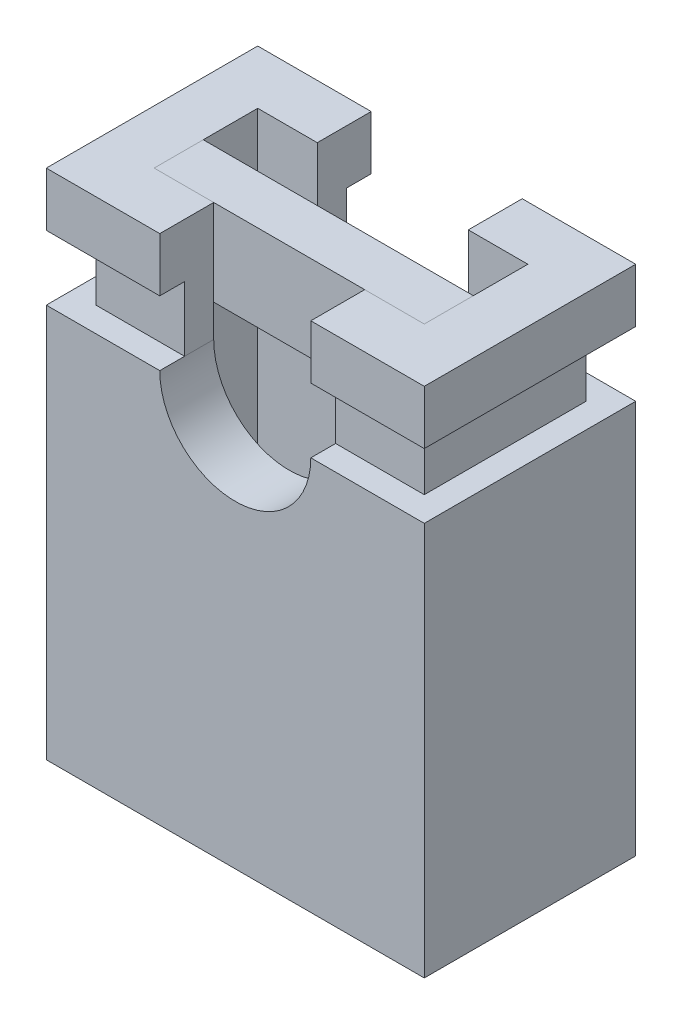
ISO-10303-21;
HEADER;
FILE_DESCRIPTION(('STEP AP214'),'2;1');
FILE_NAME('part.step','',(''),(''),'','','');
FILE_SCHEMA(('AUTOMOTIVE_DESIGN { 1 0 10303 214 1 1 1 1 }'));
ENDSEC;
DATA;
#1=APPLICATION_CONTEXT('core data for automotive mechanical design processes');
#2=APPLICATION_PROTOCOL_DEFINITION('international standard','automotive_design',2000,#1);
#3=PRODUCT_CONTEXT('',#1,'mechanical');
#4=PRODUCT('Part','Part','',(#3));
#5=PRODUCT_RELATED_PRODUCT_CATEGORY('part','',(#4));
#6=PRODUCT_DEFINITION_FORMATION('','',#4);
#7=PRODUCT_DEFINITION_CONTEXT('part definition',#1,'design');
#8=PRODUCT_DEFINITION('design','',#6,#7);
#9=PRODUCT_DEFINITION_SHAPE('','',#8);
#10=(LENGTH_UNIT() NAMED_UNIT(*) SI_UNIT(.MILLI.,.METRE.));
#11=(NAMED_UNIT(*) PLANE_ANGLE_UNIT() SI_UNIT($,.RADIAN.));
#12=(NAMED_UNIT(*) SI_UNIT($,.STERADIAN.) SOLID_ANGLE_UNIT());
#13=UNCERTAINTY_MEASURE_WITH_UNIT(LENGTH_MEASURE(1.E-05),#10,'distance_accuracy_value','');
#14=(GEOMETRIC_REPRESENTATION_CONTEXT(3) GLOBAL_UNCERTAINTY_ASSIGNED_CONTEXT((#13)) GLOBAL_UNIT_ASSIGNED_CONTEXT((#10,
#11,#12)) REPRESENTATION_CONTEXT('',''));
#15=CARTESIAN_POINT('',(0.,0.,0.));
#16=DIRECTION('',(0.,0.,1.));
#17=DIRECTION('',(1.,0.,0.));
#18=AXIS2_PLACEMENT_3D('',#15,#16,#17);
#19=CARTESIAN_POINT('',(0.,0.,0.03175));
#20=DIRECTION('',(0.,0.,1.));
#21=DIRECTION('',(1.,0.,0.));
#22=AXIS2_PLACEMENT_3D('',#19,#20,#21);
#23=PLANE('',#22);
#24=DIRECTION('',(1.,0.,0.));
#25=VECTOR('',#24,1.);
#26=CARTESIAN_POINT('',(-1.59,0.,0.03175));
#27=LINE('',#26,#25);
#28=CARTESIAN_POINT('',(1.59,0.,0.03175));
#29=VERTEX_POINT('',#28);
#30=CARTESIAN_POINT('',(-1.59,0.,0.03175));
#31=VERTEX_POINT('',#30);
#32=EDGE_CURVE('P0_E78',#29,#31,#27,.F.);
#33=ORIENTED_EDGE('',*,*,#32,.F.);
#34=DIRECTION('',(0.,1.,0.));
#35=VECTOR('',#34,1.);
#36=CARTESIAN_POINT('',(1.59,0.,0.03175));
#37=LINE('',#36,#35);
#38=CARTESIAN_POINT('',(1.59,-1.016,0.03175));
#39=VERTEX_POINT('',#38);
#40=EDGE_CURVE('P0_E54',#39,#29,#37,.T.);
#41=ORIENTED_EDGE('',*,*,#40,.F.);
#42=DIRECTION('',(1.,0.,0.));
#43=VECTOR('',#42,1.);
#44=CARTESIAN_POINT('',(-1.59,-1.016,0.03175));
#45=LINE('',#44,#43);
#46=CARTESIAN_POINT('',(-1.59,-1.016,0.03175));
#47=VERTEX_POINT('',#46);
#48=EDGE_CURVE('P0_E66',#39,#47,#45,.F.);
#49=ORIENTED_EDGE('',*,*,#48,.T.);
#50=DIRECTION('',(0.,1.,0.));
#51=VECTOR('',#50,1.);
#52=CARTESIAN_POINT('',(-1.59,0.,0.03175));
#53=LINE('',#52,#51);
#54=EDGE_CURVE('P0_E19',#47,#31,#53,.T.);
#55=ORIENTED_EDGE('',*,*,#54,.T.);
#56=EDGE_LOOP('',(#33,#41,#49,#55));
#57=FACE_BOUND('',#56,.T.);
#58=ADVANCED_FACE('P0_F16',(#57),#23,.F.);
#59=CARTESIAN_POINT('',(-1.59,0.,0.609599999999999));
#60=DIRECTION('',(1.,0.,0.));
#61=DIRECTION('',(0.,1.,0.));
#62=AXIS2_PLACEMENT_3D('',#59,#60,#61);
#63=PLANE('',#62);
#64=DIRECTION('',(0.,0.,1.));
#65=VECTOR('',#64,1.);
#66=CARTESIAN_POINT('',(-1.59,-1.016,0.609599999999999));
#67=LINE('',#66,#65);
#68=CARTESIAN_POINT('',(-1.59,-1.016,0.609599999999999));
#69=VERTEX_POINT('',#68);
#70=EDGE_CURVE('P0_E61',#47,#69,#67,.T.);
#71=ORIENTED_EDGE('',*,*,#70,.T.);
#72=DIRECTION('',(0.,1.,0.));
#73=VECTOR('',#72,1.);
#74=CARTESIAN_POINT('',(-1.59,0.,0.609599999999999));
#75=LINE('',#74,#73);
#76=CARTESIAN_POINT('',(-1.59,0.,0.609599999999999));
#77=VERTEX_POINT('',#76);
#78=EDGE_CURVE('P0_E82',#77,#69,#75,.F.);
#79=ORIENTED_EDGE('',*,*,#78,.F.);
#80=DIRECTION('',(0.,0.,1.));
#81=VECTOR('',#80,1.);
#82=CARTESIAN_POINT('',(-1.59,0.,0.609599999999999));
#83=LINE('',#82,#81);
#84=EDGE_CURVE('P0_E64',#31,#77,#83,.T.);
#85=ORIENTED_EDGE('',*,*,#84,.F.);
#86=ORIENTED_EDGE('',*,*,#54,.F.);
#87=EDGE_LOOP('',(#71,#79,#85,#86));
#88=FACE_BOUND('',#87,.T.);
#89=ADVANCED_FACE('P0_F59',(#88),#63,.F.);
#90=CARTESIAN_POINT('',(-1.59,-1.016,0.609599999999999));
#91=DIRECTION('',(0.,1.,0.));
#92=DIRECTION('',(0.,0.,1.));
#93=AXIS2_PLACEMENT_3D('',#90,#91,#92);
#94=PLANE('',#93);
#95=DIRECTION('',(0.,0.,1.));
#96=VECTOR('',#95,1.);
#97=CARTESIAN_POINT('',(1.59,-1.016,0.609599999999999));
#98=LINE('',#97,#96);
#99=CARTESIAN_POINT('',(1.59,-1.016,0.609599999999999));
#100=VERTEX_POINT('',#99);
#101=EDGE_CURVE('P0_E76',#100,#39,#98,.F.);
#102=ORIENTED_EDGE('',*,*,#101,.F.);
#103=DIRECTION('',(1.,0.,0.));
#104=VECTOR('',#103,1.);
#105=CARTESIAN_POINT('',(0.,-1.016,0.609599999999999));
#106=LINE('',#105,#104);
#107=EDGE_CURVE('P0_E72',#69,#100,#106,.T.);
#108=ORIENTED_EDGE('',*,*,#107,.F.);
#109=ORIENTED_EDGE('',*,*,#70,.F.);
#110=ORIENTED_EDGE('',*,*,#48,.F.);
#111=EDGE_LOOP('',(#102,#108,#109,#110));
#112=FACE_BOUND('',#111,.T.);
#113=ADVANCED_FACE('P0_F70',(#112),#94,.F.);
#114=CARTESIAN_POINT('',(1.59,0.,0.609599999999999));
#115=DIRECTION('',(1.,0.,0.));
#116=DIRECTION('',(0.,1.,0.));
#117=AXIS2_PLACEMENT_3D('',#114,#115,#116);
#118=PLANE('',#117);
#119=DIRECTION('',(0.,1.,0.));
#120=VECTOR('',#119,1.);
#121=CARTESIAN_POINT('',(1.59,0.,0.609599999999999));
#122=LINE('',#121,#120);
#123=CARTESIAN_POINT('',(1.59,0.,0.609599999999999));
#124=VERTEX_POINT('',#123);
#125=EDGE_CURVE('P0_E25',#100,#124,#122,.T.);
#126=ORIENTED_EDGE('',*,*,#125,.F.);
#127=ORIENTED_EDGE('',*,*,#101,.T.);
#128=ORIENTED_EDGE('',*,*,#40,.T.);
#129=DIRECTION('',(0.,0.,1.));
#130=VECTOR('',#129,1.);
#131=CARTESIAN_POINT('',(1.59,0.,0.609599999999999));
#132=LINE('',#131,#130);
#133=EDGE_CURVE('P0_E34',#124,#29,#132,.F.);
#134=ORIENTED_EDGE('',*,*,#133,.F.);
#135=EDGE_LOOP('',(#126,#127,#128,#134));
#136=FACE_BOUND('',#135,.T.);
#137=ADVANCED_FACE('P0_F88',(#136),#118,.T.);
#138=CARTESIAN_POINT('',(-1.59,0.,0.609599999999999));
#139=DIRECTION('',(0.,1.,0.));
#140=DIRECTION('',(0.,0.,1.));
#141=AXIS2_PLACEMENT_3D('',#138,#139,#140);
#142=PLANE('',#141);
#143=DIRECTION('',(1.,0.,0.));
#144=VECTOR('',#143,1.);
#145=CARTESIAN_POINT('',(0.,0.,0.609599999999999));
#146=LINE('',#145,#144);
#147=EDGE_CURVE('P0_E11',#124,#77,#146,.F.);
#148=ORIENTED_EDGE('',*,*,#147,.F.);
#149=ORIENTED_EDGE('',*,*,#133,.T.);
#150=ORIENTED_EDGE('',*,*,#32,.T.);
#151=ORIENTED_EDGE('',*,*,#84,.T.);
#152=EDGE_LOOP('',(#148,#149,#150,#151));
#153=FACE_BOUND('',#152,.T.);
#154=ADVANCED_FACE('P0_F90',(#153),#142,.T.);
#155=CARTESIAN_POINT('',(0.,0.,0.609599999999999));
#156=DIRECTION('',(0.,0.,1.));
#157=DIRECTION('',(1.,0.,0.));
#158=AXIS2_PLACEMENT_3D('',#155,#156,#157);
#159=PLANE('',#158);
#160=ORIENTED_EDGE('',*,*,#125,.T.);
#161=ORIENTED_EDGE('',*,*,#147,.T.);
#162=ORIENTED_EDGE('',*,*,#78,.T.);
#163=ORIENTED_EDGE('',*,*,#107,.T.);
#164=EDGE_LOOP('',(#160,#161,#162,#163));
#165=FACE_BOUND('',#164,.T.);
#166=ADVANCED_FACE('P0_F87',(#165),#159,.T.);
#167=CLOSED_SHELL('',(#58,#89,#113,#137,#154,#166));
#168=MANIFOLD_SOLID_BREP('P0_B1',#167);
#169=CARTESIAN_POINT('',(0.,0.,0.));
#170=DIRECTION('',(0.,1.,0.));
#171=DIRECTION('',(0.,0.,1.));
#172=AXIS2_PLACEMENT_3D('',#169,#170,#171);
#173=PLANE('',#172);
#174=DIRECTION('',(1.,0.,0.));
#175=VECTOR('',#174,1.);
#176=CARTESIAN_POINT('',(-2.225,0.,1.2446));
#177=LINE('',#176,#175);
#178=CARTESIAN_POINT('',(2.225,0.,1.2446));
#179=VERTEX_POINT('',#178);
#180=CARTESIAN_POINT('',(0.889,0.,1.2446));
#181=VERTEX_POINT('',#180);
#182=EDGE_CURVE('P1_E463',#179,#181,#177,.F.);
#183=ORIENTED_EDGE('',*,*,#182,.F.);
#184=DIRECTION('',(0.,0.,-1.));
#185=VECTOR('',#184,1.);
#186=CARTESIAN_POINT('',(2.225,0.,-1.2446));
#187=LINE('',#186,#185);
#188=CARTESIAN_POINT('',(2.225,0.,-1.2446));
#189=VERTEX_POINT('',#188);
#190=EDGE_CURVE('P1_E435',#189,#179,#187,.F.);
#191=ORIENTED_EDGE('',*,*,#190,.F.);
#192=DIRECTION('',(-1.,0.,0.));
#193=VECTOR('',#192,1.);
#194=CARTESIAN_POINT('',(-2.225,0.,-1.2446));
#195=LINE('',#194,#193);
#196=CARTESIAN_POINT('',(0.889,0.,-1.2446));
#197=VERTEX_POINT('',#196);
#198=EDGE_CURVE('P1_E454',#197,#189,#195,.F.);
#199=ORIENTED_EDGE('',*,*,#198,.F.);
#200=DIRECTION('',(0.,0.,1.));
#201=VECTOR('',#200,1.);
#202=CARTESIAN_POINT('',(0.889,0.,0.));
#203=LINE('',#202,#201);
#204=CARTESIAN_POINT('',(0.889,0.,-0.6096));
#205=VERTEX_POINT('',#204);
#206=EDGE_CURVE('P1_E502',#197,#205,#203,.T.);
#207=ORIENTED_EDGE('',*,*,#206,.T.);
#208=DIRECTION('',(1.,0.,0.));
#209=VECTOR('',#208,1.);
#210=CARTESIAN_POINT('',(0.,0.,-0.609600000000001));
#211=LINE('',#210,#209);
#212=CARTESIAN_POINT('',(1.59,0.,-0.6096));
#213=VERTEX_POINT('',#212);
#214=EDGE_CURVE('P1_E505',#205,#213,#211,.T.);
#215=ORIENTED_EDGE('',*,*,#214,.T.);
#216=DIRECTION('',(0.,0.,1.));
#217=VECTOR('',#216,1.);
#218=CARTESIAN_POINT('',(1.59,0.,0.));
#219=LINE('',#218,#217);
#220=CARTESIAN_POINT('',(1.59,0.,0.6096));
#221=VERTEX_POINT('',#220);
#222=EDGE_CURVE('P1_E540',#213,#221,#219,.T.);
#223=ORIENTED_EDGE('',*,*,#222,.T.);
#224=DIRECTION('',(1.,0.,0.));
#225=VECTOR('',#224,1.);
#226=CARTESIAN_POINT('',(0.,0.,0.6096));
#227=LINE('',#226,#225);
#228=CARTESIAN_POINT('',(0.889,0.,0.6096));
#229=VERTEX_POINT('',#228);
#230=EDGE_CURVE('P1_E510',#221,#229,#227,.F.);
#231=ORIENTED_EDGE('',*,*,#230,.T.);
#232=DIRECTION('',(0.,0.,1.));
#233=VECTOR('',#232,1.);
#234=CARTESIAN_POINT('',(0.889,0.,0.));
#235=LINE('',#234,#233);
#236=EDGE_CURVE('P1_E508',#229,#181,#235,.T.);
#237=ORIENTED_EDGE('',*,*,#236,.T.);
#238=EDGE_LOOP('',(#183,#191,#199,#207,#215,#223,#231,#237));
#239=FACE_BOUND('',#238,.T.);
#240=ADVANCED_FACE('P1_F16',(#239),#173,.T.);
#241=CARTESIAN_POINT('',(0.,0.,0.));
#242=DIRECTION('',(0.,1.,0.));
#243=DIRECTION('',(0.,0.,1.));
#244=AXIS2_PLACEMENT_3D('',#241,#242,#243);
#245=PLANE('',#244);
#246=DIRECTION('',(0.,0.,1.));
#247=VECTOR('',#246,1.);
#248=CARTESIAN_POINT('',(-1.59,0.,0.));
#249=LINE('',#248,#247);
#250=CARTESIAN_POINT('',(-1.59,0.,0.609599999999999));
#251=VERTEX_POINT('',#250);
#252=CARTESIAN_POINT('',(-1.59,0.,-0.6096));
#253=VERTEX_POINT('',#252);
#254=EDGE_CURVE('P1_E519',#251,#253,#249,.F.);
#255=ORIENTED_EDGE('',*,*,#254,.T.);
#256=DIRECTION('',(1.,0.,0.));
#257=VECTOR('',#256,1.);
#258=CARTESIAN_POINT('',(0.,0.,-0.6096));
#259=LINE('',#258,#257);
#260=CARTESIAN_POINT('',(-0.889,0.,-0.6096));
#261=VERTEX_POINT('',#260);
#262=EDGE_CURVE('P1_E492',#253,#261,#259,.T.);
#263=ORIENTED_EDGE('',*,*,#262,.T.);
#264=DIRECTION('',(0.,0.,1.));
#265=VECTOR('',#264,1.);
#266=CARTESIAN_POINT('',(-0.889,0.,0.));
#267=LINE('',#266,#265);
#268=CARTESIAN_POINT('',(-0.889,0.,-1.2446));
#269=VERTEX_POINT('',#268);
#270=EDGE_CURVE('P1_E481',#261,#269,#267,.F.);
#271=ORIENTED_EDGE('',*,*,#270,.T.);
#272=DIRECTION('',(1.,0.,0.));
#273=VECTOR('',#272,1.);
#274=CARTESIAN_POINT('',(0.,0.,-1.2446));
#275=LINE('',#274,#273);
#276=CARTESIAN_POINT('',(-2.225,0.,-1.2446));
#277=VERTEX_POINT('',#276);
#278=EDGE_CURVE('P1_E478',#269,#277,#275,.F.);
#279=ORIENTED_EDGE('',*,*,#278,.T.);
#280=DIRECTION('',(0.,0.,1.));
#281=VECTOR('',#280,1.);
#282=CARTESIAN_POINT('',(-2.225,0.,-1.2446));
#283=LINE('',#282,#281);
#284=CARTESIAN_POINT('',(-2.225,0.,1.2446));
#285=VERTEX_POINT('',#284);
#286=EDGE_CURVE('P1_E415',#285,#277,#283,.F.);
#287=ORIENTED_EDGE('',*,*,#286,.F.);
#288=DIRECTION('',(1.,0.,0.));
#289=VECTOR('',#288,1.);
#290=CARTESIAN_POINT('',(-2.225,0.,1.2446));
#291=LINE('',#290,#289);
#292=CARTESIAN_POINT('',(-0.889,0.,1.2446));
#293=VERTEX_POINT('',#292);
#294=EDGE_CURVE('P1_E429',#293,#285,#291,.F.);
#295=ORIENTED_EDGE('',*,*,#294,.F.);
#296=DIRECTION('',(0.,0.,1.));
#297=VECTOR('',#296,1.);
#298=CARTESIAN_POINT('',(-0.889,0.,0.));
#299=LINE('',#298,#297);
#300=CARTESIAN_POINT('',(-0.889,0.,0.609599999999999));
#301=VERTEX_POINT('',#300);
#302=EDGE_CURVE('P1_E480',#293,#301,#299,.F.);
#303=ORIENTED_EDGE('',*,*,#302,.T.);
#304=DIRECTION('',(1.,0.,0.));
#305=VECTOR('',#304,1.);
#306=CARTESIAN_POINT('',(0.,0.,0.609599999999999));
#307=LINE('',#306,#305);
#308=EDGE_CURVE('P1_E216',#301,#251,#307,.F.);
#309=ORIENTED_EDGE('',*,*,#308,.T.);
#310=EDGE_LOOP('',(#255,#263,#271,#279,#287,#295,#303,#309));
#311=FACE_BOUND('',#310,.T.);
#312=ADVANCED_FACE('P1_F668',(#311),#245,.T.);
#313=CARTESIAN_POINT('',(-2.225,-6.0325,1.2446));
#314=DIRECTION('',(0.,0.,1.));
#315=DIRECTION('',(1.,0.,0.));
#316=AXIS2_PLACEMENT_3D('',#313,#314,#315);
#317=PLANE('',#316);
#318=DIRECTION('',(1.,0.,0.));
#319=VECTOR('',#318,1.);
#320=CARTESIAN_POINT('',(0.,-0.635,1.2446));
#321=LINE('',#320,#319);
#322=CARTESIAN_POINT('',(2.225,-0.635,1.2446));
#323=VERTEX_POINT('',#322);
#324=CARTESIAN_POINT('',(0.889,-0.635,1.2446));
#325=VERTEX_POINT('',#324);
#326=EDGE_CURVE('P1_E409',#323,#325,#321,.F.);
#327=ORIENTED_EDGE('',*,*,#326,.F.);
#328=DIRECTION('',(0.,1.,0.));
#329=VECTOR('',#328,1.);
#330=CARTESIAN_POINT('',(2.225,-6.0325,1.2446));
#331=LINE('',#330,#329);
#332=EDGE_CURVE('P1_E441',#179,#323,#331,.F.);
#333=ORIENTED_EDGE('',*,*,#332,.F.);
#334=ORIENTED_EDGE('',*,*,#182,.T.);
#335=DIRECTION('',(0.,1.,0.));
#336=VECTOR('',#335,1.);
#337=CARTESIAN_POINT('',(0.889,-6.0325,1.2446));
#338=LINE('',#337,#336);
#339=EDGE_CURVE('P1_E455',#181,#325,#338,.F.);
#340=ORIENTED_EDGE('',*,*,#339,.T.);
#341=EDGE_LOOP('',(#327,#333,#334,#340));
#342=FACE_BOUND('',#341,.T.);
#343=ADVANCED_FACE('P1_F652',(#342),#317,.T.);
#344=CARTESIAN_POINT('',(-2.225,-6.0325,-1.2446));
#345=DIRECTION('',(0.,0.,-1.));
#346=DIRECTION('',(-1.,0.,0.));
#347=AXIS2_PLACEMENT_3D('',#344,#345,#346);
#348=PLANE('',#347);
#349=ORIENTED_EDGE('',*,*,#198,.T.);
#350=DIRECTION('',(0.,1.,0.));
#351=VECTOR('',#350,1.);
#352=CARTESIAN_POINT('',(2.225,-6.0325,-1.2446));
#353=LINE('',#352,#351);
#354=CARTESIAN_POINT('',(2.225,-0.635000000000001,-1.2446));
#355=VERTEX_POINT('',#354);
#356=EDGE_CURVE('P1_E438',#355,#189,#353,.T.);
#357=ORIENTED_EDGE('',*,*,#356,.F.);
#358=DIRECTION('',(1.,0.,0.));
#359=VECTOR('',#358,1.);
#360=CARTESIAN_POINT('',(0.,-0.635,-1.2446));
#361=LINE('',#360,#359);
#362=CARTESIAN_POINT('',(0.889,-0.635,-1.2446));
#363=VERTEX_POINT('',#362);
#364=EDGE_CURVE('P1_E444',#363,#355,#361,.T.);
#365=ORIENTED_EDGE('',*,*,#364,.F.);
#366=DIRECTION('',(0.,1.,0.));
#367=VECTOR('',#366,1.);
#368=CARTESIAN_POINT('',(0.889,-6.0325,-1.2446));
#369=LINE('',#368,#367);
#370=EDGE_CURVE('P1_E451',#363,#197,#369,.T.);
#371=ORIENTED_EDGE('',*,*,#370,.T.);
#372=EDGE_LOOP('',(#349,#357,#365,#371));
#373=FACE_BOUND('',#372,.T.);
#374=ADVANCED_FACE('P1_F658',(#373),#348,.T.);
#375=CARTESIAN_POINT('',(2.225,-6.0325,-1.2446));
#376=DIRECTION('',(1.,0.,0.));
#377=DIRECTION('',(0.,0.,-1.));
#378=AXIS2_PLACEMENT_3D('',#375,#376,#377);
#379=PLANE('',#378);
#380=ORIENTED_EDGE('',*,*,#356,.T.);
#381=ORIENTED_EDGE('',*,*,#190,.T.);
#382=ORIENTED_EDGE('',*,*,#332,.T.);
#383=DIRECTION('',(0.,0.,-1.));
#384=VECTOR('',#383,1.);
#385=CARTESIAN_POINT('',(2.225,-0.635,0.));
#386=LINE('',#385,#384);
#387=EDGE_CURVE('P1_E394',#355,#323,#386,.F.);
#388=ORIENTED_EDGE('',*,*,#387,.F.);
#389=EDGE_LOOP('',(#380,#381,#382,#388));
#390=FACE_BOUND('',#389,.T.);
#391=ADVANCED_FACE('P1_F654',(#390),#379,.T.);
#392=CARTESIAN_POINT('',(-2.225,-6.0325,1.2446));
#393=DIRECTION('',(0.,0.,1.));
#394=DIRECTION('',(1.,0.,0.));
#395=AXIS2_PLACEMENT_3D('',#392,#393,#394);
#396=PLANE('',#395);
#397=DIRECTION('',(0.,1.,0.));
#398=VECTOR('',#397,1.);
#399=CARTESIAN_POINT('',(-2.225,-6.0325,1.2446));
#400=LINE('',#399,#398);
#401=CARTESIAN_POINT('',(-2.225,-0.635,1.2446));
#402=VERTEX_POINT('',#401);
#403=EDGE_CURVE('P1_E426',#402,#285,#400,.T.);
#404=ORIENTED_EDGE('',*,*,#403,.F.);
#405=DIRECTION('',(1.,0.,0.));
#406=VECTOR('',#405,1.);
#407=CARTESIAN_POINT('',(0.,-0.635,1.2446));
#408=LINE('',#407,#406);
#409=CARTESIAN_POINT('',(-0.889,-0.635,1.2446));
#410=VERTEX_POINT('',#409);
#411=EDGE_CURVE('P1_E391',#410,#402,#408,.F.);
#412=ORIENTED_EDGE('',*,*,#411,.F.);
#413=DIRECTION('',(0.,1.,0.));
#414=VECTOR('',#413,1.);
#415=CARTESIAN_POINT('',(-0.889,-6.0325,1.2446));
#416=LINE('',#415,#414);
#417=EDGE_CURVE('P1_E432',#410,#293,#416,.T.);
#418=ORIENTED_EDGE('',*,*,#417,.T.);
#419=ORIENTED_EDGE('',*,*,#294,.T.);
#420=EDGE_LOOP('',(#404,#412,#418,#419));
#421=FACE_BOUND('',#420,.T.);
#422=ADVANCED_FACE('P1_F666',(#421),#396,.T.);
#423=CARTESIAN_POINT('',(-2.225,-6.0325,-1.2446));
#424=DIRECTION('',(-1.,0.,0.));
#425=DIRECTION('',(0.,0.,1.));
#426=AXIS2_PLACEMENT_3D('',#423,#424,#425);
#427=PLANE('',#426);
#428=ORIENTED_EDGE('',*,*,#403,.T.);
#429=ORIENTED_EDGE('',*,*,#286,.T.);
#430=DIRECTION('',(0.,1.,0.));
#431=VECTOR('',#430,1.);
#432=CARTESIAN_POINT('',(-2.225,-6.0325,-1.2446));
#433=LINE('',#432,#431);
#434=CARTESIAN_POINT('',(-2.225,-0.635,-1.2446));
#435=VERTEX_POINT('',#434);
#436=EDGE_CURVE('P1_E414',#435,#277,#433,.T.);
#437=ORIENTED_EDGE('',*,*,#436,.F.);
#438=DIRECTION('',(0.,0.,-1.));
#439=VECTOR('',#438,1.);
#440=CARTESIAN_POINT('',(-2.225,-0.635,0.));
#441=LINE('',#440,#439);
#442=EDGE_CURVE('P1_E384',#402,#435,#441,.T.);
#443=ORIENTED_EDGE('',*,*,#442,.F.);
#444=EDGE_LOOP('',(#428,#429,#437,#443));
#445=FACE_BOUND('',#444,.T.);
#446=ADVANCED_FACE('P1_F749',(#445),#427,.T.);
#447=CARTESIAN_POINT('',(-2.225,-6.0325,-1.2446));
#448=DIRECTION('',(0.,0.,-1.));
#449=DIRECTION('',(-1.,0.,0.));
#450=AXIS2_PLACEMENT_3D('',#447,#448,#449);
#451=PLANE('',#450);
#452=ORIENTED_EDGE('',*,*,#436,.T.);
#453=ORIENTED_EDGE('',*,*,#278,.F.);
#454=DIRECTION('',(0.,1.,0.));
#455=VECTOR('',#454,1.);
#456=CARTESIAN_POINT('',(-0.889,-6.0325,-1.2446));
#457=LINE('',#456,#455);
#458=CARTESIAN_POINT('',(-0.889,-0.635,-1.2446));
#459=VERTEX_POINT('',#458);
#460=EDGE_CURVE('P1_E412',#269,#459,#457,.F.);
#461=ORIENTED_EDGE('',*,*,#460,.T.);
#462=DIRECTION('',(1.,0.,0.));
#463=VECTOR('',#462,1.);
#464=CARTESIAN_POINT('',(0.,-0.635,-1.2446));
#465=LINE('',#464,#463);
#466=EDGE_CURVE('P1_E372',#435,#459,#465,.T.);
#467=ORIENTED_EDGE('',*,*,#466,.F.);
#468=EDGE_LOOP('',(#452,#453,#461,#467));
#469=FACE_BOUND('',#468,.T.);
#470=ADVANCED_FACE('P1_F746',(#469),#451,.T.);
#471=CARTESIAN_POINT('',(0.,-0.635,0.));
#472=DIRECTION('',(0.,-1.,0.));
#473=DIRECTION('',(0.,0.,-1.));
#474=AXIS2_PLACEMENT_3D('',#471,#472,#473);
#475=PLANE('',#474);
#476=ORIENTED_EDGE('',*,*,#364,.T.);
#477=ORIENTED_EDGE('',*,*,#387,.T.);
#478=ORIENTED_EDGE('',*,*,#326,.T.);
#479=DIRECTION('',(0.,0.,-1.));
#480=VECTOR('',#479,1.);
#481=CARTESIAN_POINT('',(0.889,-0.635,0.));
#482=LINE('',#481,#480);
#483=CARTESIAN_POINT('',(0.889,-0.635,0.952499999999999));
#484=VERTEX_POINT('',#483);
#485=EDGE_CURVE('P1_E405',#325,#484,#482,.T.);
#486=ORIENTED_EDGE('',*,*,#485,.T.);
#487=DIRECTION('',(1.,0.,0.));
#488=VECTOR('',#487,1.);
#489=CARTESIAN_POINT('',(-1.9329,-0.635,0.9525));
#490=LINE('',#489,#488);
#491=CARTESIAN_POINT('',(1.9329,-0.635,0.9525));
#492=VERTEX_POINT('',#491);
#493=EDGE_CURVE('P1_E371',#492,#484,#490,.F.);
#494=ORIENTED_EDGE('',*,*,#493,.F.);
#495=DIRECTION('',(0.,0.,-1.));
#496=VECTOR('',#495,1.);
#497=CARTESIAN_POINT('',(1.9329,-0.635,0.9525));
#498=LINE('',#497,#496);
#499=CARTESIAN_POINT('',(1.9329,-0.635,-0.9525));
#500=VERTEX_POINT('',#499);
#501=EDGE_CURVE('P1_E347',#500,#492,#498,.F.);
#502=ORIENTED_EDGE('',*,*,#501,.F.);
#503=DIRECTION('',(1.,0.,0.));
#504=VECTOR('',#503,1.);
#505=CARTESIAN_POINT('',(0.,-0.635,-0.9525));
#506=LINE('',#505,#504);
#507=CARTESIAN_POINT('',(0.889,-0.635,-0.9525));
#508=VERTEX_POINT('',#507);
#509=EDGE_CURVE('P1_E401',#500,#508,#506,.F.);
#510=ORIENTED_EDGE('',*,*,#509,.T.);
#511=DIRECTION('',(0.,0.,-1.));
#512=VECTOR('',#511,1.);
#513=CARTESIAN_POINT('',(0.889,-0.635,0.));
#514=LINE('',#513,#512);
#515=EDGE_CURVE('P1_E404',#508,#363,#514,.T.);
#516=ORIENTED_EDGE('',*,*,#515,.T.);
#517=EDGE_LOOP('',(#476,#477,#478,#486,#494,#502,#510,#516));
#518=FACE_BOUND('',#517,.T.);
#519=ADVANCED_FACE('P1_F638',(#518),#475,.T.);
#520=CARTESIAN_POINT('',(0.,-0.635,0.));
#521=DIRECTION('',(0.,-1.,0.));
#522=DIRECTION('',(0.,0.,-1.));
#523=AXIS2_PLACEMENT_3D('',#520,#521,#522);
#524=PLANE('',#523);
#525=DIRECTION('',(0.,0.,1.));
#526=VECTOR('',#525,1.);
#527=CARTESIAN_POINT('',(-1.9329,-0.635,0.9525));
#528=LINE('',#527,#526);
#529=CARTESIAN_POINT('',(-1.9329,-0.635,0.9525));
#530=VERTEX_POINT('',#529);
#531=CARTESIAN_POINT('',(-1.9329,-0.635,-0.9525));
#532=VERTEX_POINT('',#531);
#533=EDGE_CURVE('P1_E299',#530,#532,#528,.F.);
#534=ORIENTED_EDGE('',*,*,#533,.F.);
#535=DIRECTION('',(1.,0.,0.));
#536=VECTOR('',#535,1.);
#537=CARTESIAN_POINT('',(0.,-0.635,0.9525));
#538=LINE('',#537,#536);
#539=CARTESIAN_POINT('',(-0.889,-0.635,0.9525));
#540=VERTEX_POINT('',#539);
#541=EDGE_CURVE('P1_E369',#530,#540,#538,.T.);
#542=ORIENTED_EDGE('',*,*,#541,.T.);
#543=DIRECTION('',(0.,0.,1.));
#544=VECTOR('',#543,1.);
#545=CARTESIAN_POINT('',(-0.889,-0.635,-1.2446));
#546=LINE('',#545,#544);
#547=EDGE_CURVE('P1_E338',#540,#410,#546,.T.);
#548=ORIENTED_EDGE('',*,*,#547,.T.);
#549=ORIENTED_EDGE('',*,*,#411,.T.);
#550=ORIENTED_EDGE('',*,*,#442,.T.);
#551=ORIENTED_EDGE('',*,*,#466,.T.);
#552=DIRECTION('',(0.,0.,1.));
#553=VECTOR('',#552,1.);
#554=CARTESIAN_POINT('',(-0.889,-0.635,-1.2446));
#555=LINE('',#554,#553);
#556=CARTESIAN_POINT('',(-0.889,-0.635,-0.9525));
#557=VERTEX_POINT('',#556);
#558=EDGE_CURVE('P1_E317',#459,#557,#555,.T.);
#559=ORIENTED_EDGE('',*,*,#558,.T.);
#560=DIRECTION('',(-1.,0.,0.));
#561=VECTOR('',#560,1.);
#562=CARTESIAN_POINT('',(-1.9329,-0.635,-0.9525));
#563=LINE('',#562,#561);
#564=EDGE_CURVE('P1_E305',#532,#557,#563,.F.);
#565=ORIENTED_EDGE('',*,*,#564,.F.);
#566=EDGE_LOOP('',(#534,#542,#548,#549,#550,#551,#559,#565));
#567=FACE_BOUND('',#566,.T.);
#568=ADVANCED_FACE('P1_F740',(#567),#524,.T.);
#569=CARTESIAN_POINT('',(-1.9329,-1.397,0.9525));
#570=DIRECTION('',(0.,0.,1.));
#571=DIRECTION('',(1.,0.,0.));
#572=AXIS2_PLACEMENT_3D('',#569,#570,#571);
#573=PLANE('',#572);
#574=DIRECTION('',(1.,0.,0.));
#575=VECTOR('',#574,1.);
#576=CARTESIAN_POINT('',(0.,-1.397,0.952499999999999));
#577=LINE('',#576,#575);
#578=CARTESIAN_POINT('',(0.889,-1.397,0.952499999999999));
#579=VERTEX_POINT('',#578);
#580=CARTESIAN_POINT('',(1.9329,-1.397,0.952499999999999));
#581=VERTEX_POINT('',#580);
#582=EDGE_CURVE('P1_E247',#579,#581,#577,.T.);
#583=ORIENTED_EDGE('',*,*,#582,.T.);
#584=DIRECTION('',(0.,1.,0.));
#585=VECTOR('',#584,1.);
#586=CARTESIAN_POINT('',(1.9329,-1.397,0.9525));
#587=LINE('',#586,#585);
#588=EDGE_CURVE('P1_E339',#492,#581,#587,.F.);
#589=ORIENTED_EDGE('',*,*,#588,.F.);
#590=ORIENTED_EDGE('',*,*,#493,.T.);
#591=DIRECTION('',(0.,-1.,0.));
#592=VECTOR('',#591,1.);
#593=CARTESIAN_POINT('',(0.889,0.,0.952499999999999));
#594=LINE('',#593,#592);
#595=EDGE_CURVE('P1_E326',#579,#484,#594,.F.);
#596=ORIENTED_EDGE('',*,*,#595,.F.);
#597=EDGE_LOOP('',(#583,#589,#590,#596));
#598=FACE_BOUND('',#597,.T.);
#599=ADVANCED_FACE('P1_F647',(#598),#573,.T.);
#600=CARTESIAN_POINT('',(1.9329,-1.397,0.9525));
#601=DIRECTION('',(1.,0.,0.));
#602=DIRECTION('',(0.,0.,-1.));
#603=AXIS2_PLACEMENT_3D('',#600,#601,#602);
#604=PLANE('',#603);
#605=DIRECTION('',(0.,0.,-1.));
#606=VECTOR('',#605,1.);
#607=CARTESIAN_POINT('',(1.9329,-1.397,0.));
#608=LINE('',#607,#606);
#609=CARTESIAN_POINT('',(1.9329,-1.397,-0.9525));
#610=VERTEX_POINT('',#609);
#611=EDGE_CURVE('P1_E234',#581,#610,#608,.T.);
#612=ORIENTED_EDGE('',*,*,#611,.T.);
#613=DIRECTION('',(0.,1.,0.));
#614=VECTOR('',#613,1.);
#615=CARTESIAN_POINT('',(1.9329,-1.397,-0.9525));
#616=LINE('',#615,#614);
#617=EDGE_CURVE('P1_E335',#500,#610,#616,.F.);
#618=ORIENTED_EDGE('',*,*,#617,.F.);
#619=ORIENTED_EDGE('',*,*,#501,.T.);
#620=ORIENTED_EDGE('',*,*,#588,.T.);
#621=EDGE_LOOP('',(#612,#618,#619,#620));
#622=FACE_BOUND('',#621,.T.);
#623=ADVANCED_FACE('P1_F642',(#622),#604,.T.);
#624=CARTESIAN_POINT('',(-1.9329,-1.397,-0.9525));
#625=DIRECTION('',(0.,0.,-1.));
#626=DIRECTION('',(-1.,0.,0.));
#627=AXIS2_PLACEMENT_3D('',#624,#625,#626);
#628=PLANE('',#627);
#629=ORIENTED_EDGE('',*,*,#509,.F.);
#630=ORIENTED_EDGE('',*,*,#617,.T.);
#631=DIRECTION('',(1.,0.,0.));
#632=VECTOR('',#631,1.);
#633=CARTESIAN_POINT('',(0.,-1.397,-0.9525));
#634=LINE('',#633,#632);
#635=CARTESIAN_POINT('',(0.889,-1.397,-0.9525));
#636=VERTEX_POINT('',#635);
#637=EDGE_CURVE('P1_E229',#610,#636,#634,.F.);
#638=ORIENTED_EDGE('',*,*,#637,.T.);
#639=DIRECTION('',(0.,-1.,0.));
#640=VECTOR('',#639,1.);
#641=CARTESIAN_POINT('',(0.889,0.,-0.9525));
#642=LINE('',#641,#640);
#643=EDGE_CURVE('P1_E312',#508,#636,#642,.T.);
#644=ORIENTED_EDGE('',*,*,#643,.F.);
#645=EDGE_LOOP('',(#629,#630,#638,#644));
#646=FACE_BOUND('',#645,.T.);
#647=ADVANCED_FACE('P1_F632',(#646),#628,.T.);
#648=CARTESIAN_POINT('',(-0.889,0.,-1.2446));
#649=DIRECTION('',(-1.,0.,0.));
#650=DIRECTION('',(0.,-1.,0.));
#651=AXIS2_PLACEMENT_3D('',#648,#649,#650);
#652=PLANE('',#651);
#653=ORIENTED_EDGE('',*,*,#417,.F.);
#654=ORIENTED_EDGE('',*,*,#547,.F.);
#655=DIRECTION('',(0.,1.,0.));
#656=VECTOR('',#655,1.);
#657=CARTESIAN_POINT('',(-0.889,-1.397,0.9525));
#658=LINE('',#657,#656);
#659=CARTESIAN_POINT('',(-0.889,-1.397,0.9525));
#660=VERTEX_POINT('',#659);
#661=EDGE_CURVE('P1_E203',#660,#540,#658,.T.);
#662=ORIENTED_EDGE('',*,*,#661,.F.);
#663=DIRECTION('',(0.,0.,1.));
#664=VECTOR('',#663,1.);
#665=CARTESIAN_POINT('',(-0.889,-1.397,-1.2446));
#666=LINE('',#665,#664);
#667=CARTESIAN_POINT('',(-0.889,-1.397,0.6096));
#668=VERTEX_POINT('',#667);
#669=EDGE_CURVE('P1_E196',#660,#668,#666,.F.);
#670=ORIENTED_EDGE('',*,*,#669,.T.);
#671=DIRECTION('',(0.,1.,0.));
#672=VECTOR('',#671,1.);
#673=CARTESIAN_POINT('',(-0.889,-6.0325,0.6096));
#674=LINE('',#673,#672);
#675=EDGE_CURVE('P1_E199',#668,#301,#674,.T.);
#676=ORIENTED_EDGE('',*,*,#675,.T.);
#677=ORIENTED_EDGE('',*,*,#302,.F.);
#678=EDGE_LOOP('',(#653,#654,#662,#670,#676,#677));
#679=FACE_BOUND('',#678,.T.);
#680=ADVANCED_FACE('P1_F197',(#679),#652,.F.);
#681=CARTESIAN_POINT('',(0.889,0.,-1.2446));
#682=DIRECTION('',(-1.,0.,0.));
#683=DIRECTION('',(0.,-1.,0.));
#684=AXIS2_PLACEMENT_3D('',#681,#682,#683);
#685=PLANE('',#684);
#686=ORIENTED_EDGE('',*,*,#339,.F.);
#687=ORIENTED_EDGE('',*,*,#236,.F.);
#688=DIRECTION('',(0.,1.,0.));
#689=VECTOR('',#688,1.);
#690=CARTESIAN_POINT('',(0.889,-6.0325,0.6096));
#691=LINE('',#690,#689);
#692=CARTESIAN_POINT('',(0.889,-1.397,0.6096));
#693=VERTEX_POINT('',#692);
#694=EDGE_CURVE('P1_E545',#229,#693,#691,.F.);
#695=ORIENTED_EDGE('',*,*,#694,.T.);
#696=DIRECTION('',(0.,0.,1.));
#697=VECTOR('',#696,1.);
#698=CARTESIAN_POINT('',(0.889,-1.397,-1.2446));
#699=LINE('',#698,#697);
#700=EDGE_CURVE('P1_E190',#693,#579,#699,.T.);
#701=ORIENTED_EDGE('',*,*,#700,.T.);
#702=ORIENTED_EDGE('',*,*,#595,.T.);
#703=ORIENTED_EDGE('',*,*,#485,.F.);
#704=EDGE_LOOP('',(#686,#687,#695,#701,#702,#703));
#705=FACE_BOUND('',#704,.T.);
#706=ADVANCED_FACE('P1_F589',(#705),#685,.T.);
#707=CARTESIAN_POINT('',(1.59,-6.0325,-0.6096));
#708=DIRECTION('',(1.,0.,0.));
#709=DIRECTION('',(0.,0.,-1.));
#710=AXIS2_PLACEMENT_3D('',#707,#708,#709);
#711=PLANE('',#710);
#712=DIRECTION('',(0.,1.,0.));
#713=VECTOR('',#712,1.);
#714=CARTESIAN_POINT('',(1.59,-6.0325,-0.6096));
#715=LINE('',#714,#713);
#716=CARTESIAN_POINT('',(1.59,-6.0325,-0.6096));
#717=VERTEX_POINT('',#716);
#718=EDGE_CURVE('P1_E526',#213,#717,#715,.F.);
#719=ORIENTED_EDGE('',*,*,#718,.T.);
#720=DIRECTION('',(0.,0.,-1.));
#721=VECTOR('',#720,1.);
#722=CARTESIAN_POINT('',(1.59,-6.0325,-0.6096));
#723=LINE('',#722,#721);
#724=CARTESIAN_POINT('',(1.59,-6.0325,0.6096));
#725=VERTEX_POINT('',#724);
#726=EDGE_CURVE('P1_E323',#725,#717,#723,.T.);
#727=ORIENTED_EDGE('',*,*,#726,.F.);
#728=DIRECTION('',(0.,1.,0.));
#729=VECTOR('',#728,1.);
#730=CARTESIAN_POINT('',(1.59,-6.0325,0.6096));
#731=LINE('',#730,#729);
#732=EDGE_CURVE('P1_E220',#725,#221,#731,.T.);
#733=ORIENTED_EDGE('',*,*,#732,.T.);
#734=ORIENTED_EDGE('',*,*,#222,.F.);
#735=EDGE_LOOP('',(#719,#727,#733,#734));
#736=FACE_BOUND('',#735,.T.);
#737=ADVANCED_FACE('P1_F594',(#736),#711,.F.);
#738=CARTESIAN_POINT('',(-1.59,-6.0325,-0.6096));
#739=DIRECTION('',(-1.,0.,0.));
#740=DIRECTION('',(0.,0.,1.));
#741=AXIS2_PLACEMENT_3D('',#738,#739,#740);
#742=PLANE('',#741);
#743=DIRECTION('',(0.,1.,0.));
#744=VECTOR('',#743,1.);
#745=CARTESIAN_POINT('',(-1.59,-6.0325,0.6096));
#746=LINE('',#745,#744);
#747=CARTESIAN_POINT('',(-1.59,-6.0325,0.6096));
#748=VERTEX_POINT('',#747);
#749=EDGE_CURVE('P1_E217',#251,#748,#746,.F.);
#750=ORIENTED_EDGE('',*,*,#749,.T.);
#751=DIRECTION('',(0.,0.,1.));
#752=VECTOR('',#751,1.);
#753=CARTESIAN_POINT('',(-1.59,-6.0325,-0.6096));
#754=LINE('',#753,#752);
#755=CARTESIAN_POINT('',(-1.59,-6.0325,-0.6096));
#756=VERTEX_POINT('',#755);
#757=EDGE_CURVE('P1_E320',#756,#748,#754,.T.);
#758=ORIENTED_EDGE('',*,*,#757,.F.);
#759=DIRECTION('',(0.,1.,0.));
#760=VECTOR('',#759,1.);
#761=CARTESIAN_POINT('',(-1.59,-6.0325,-0.6096));
#762=LINE('',#761,#760);
#763=EDGE_CURVE('P1_E522',#756,#253,#762,.T.);
#764=ORIENTED_EDGE('',*,*,#763,.T.);
#765=ORIENTED_EDGE('',*,*,#254,.F.);
#766=EDGE_LOOP('',(#750,#758,#764,#765));
#767=FACE_BOUND('',#766,.T.);
#768=ADVANCED_FACE('P1_F723',(#767),#742,.F.);
#769=CARTESIAN_POINT('',(-0.889,0.,-1.2446));
#770=DIRECTION('',(-1.,0.,0.));
#771=DIRECTION('',(0.,-1.,0.));
#772=AXIS2_PLACEMENT_3D('',#769,#770,#771);
#773=PLANE('',#772);
#774=DIRECTION('',(0.,1.,0.));
#775=VECTOR('',#774,1.);
#776=CARTESIAN_POINT('',(-0.889,-1.397,-0.9525));
#777=LINE('',#776,#775);
#778=CARTESIAN_POINT('',(-0.889,-1.397,-0.9525));
#779=VERTEX_POINT('',#778);
#780=EDGE_CURVE('P1_E302',#557,#779,#777,.F.);
#781=ORIENTED_EDGE('',*,*,#780,.F.);
#782=ORIENTED_EDGE('',*,*,#558,.F.);
#783=ORIENTED_EDGE('',*,*,#460,.F.);
#784=ORIENTED_EDGE('',*,*,#270,.F.);
#785=DIRECTION('',(0.,1.,0.));
#786=VECTOR('',#785,1.);
#787=CARTESIAN_POINT('',(-0.889,-6.0325,-0.6096));
#788=LINE('',#787,#786);
#789=CARTESIAN_POINT('',(-0.889,-1.397,-0.6096));
#790=VERTEX_POINT('',#789);
#791=EDGE_CURVE('P1_E525',#261,#790,#788,.F.);
#792=ORIENTED_EDGE('',*,*,#791,.T.);
#793=DIRECTION('',(0.,0.,1.));
#794=VECTOR('',#793,1.);
#795=CARTESIAN_POINT('',(-0.889,-1.397,-1.2446));
#796=LINE('',#795,#794);
#797=EDGE_CURVE('P1_E315',#779,#790,#796,.T.);
#798=ORIENTED_EDGE('',*,*,#797,.F.);
#799=EDGE_LOOP('',(#781,#782,#783,#784,#792,#798));
#800=FACE_BOUND('',#799,.T.);
#801=ADVANCED_FACE('P1_F720',(#800),#773,.F.);
#802=CARTESIAN_POINT('',(0.889,0.,-1.2446));
#803=DIRECTION('',(-1.,0.,0.));
#804=DIRECTION('',(0.,-1.,0.));
#805=AXIS2_PLACEMENT_3D('',#802,#803,#804);
#806=PLANE('',#805);
#807=ORIENTED_EDGE('',*,*,#643,.T.);
#808=DIRECTION('',(0.,0.,1.));
#809=VECTOR('',#808,1.);
#810=CARTESIAN_POINT('',(0.889,-1.397,-1.2446));
#811=LINE('',#810,#809);
#812=CARTESIAN_POINT('',(0.889,-1.397,-0.6096));
#813=VERTEX_POINT('',#812);
#814=EDGE_CURVE('P1_E306',#636,#813,#811,.T.);
#815=ORIENTED_EDGE('',*,*,#814,.T.);
#816=DIRECTION('',(0.,1.,0.));
#817=VECTOR('',#816,1.);
#818=CARTESIAN_POINT('',(0.889,-6.0325,-0.6096));
#819=LINE('',#818,#817);
#820=EDGE_CURVE('P1_E239',#813,#205,#819,.T.);
#821=ORIENTED_EDGE('',*,*,#820,.T.);
#822=ORIENTED_EDGE('',*,*,#206,.F.);
#823=ORIENTED_EDGE('',*,*,#370,.F.);
#824=ORIENTED_EDGE('',*,*,#515,.F.);
#825=EDGE_LOOP('',(#807,#815,#821,#822,#823,#824));
#826=FACE_BOUND('',#825,.T.);
#827=ADVANCED_FACE('P1_F635',(#826),#806,.T.);
#828=CARTESIAN_POINT('',(-1.9329,-1.397,-0.9525));
#829=DIRECTION('',(0.,0.,-1.));
#830=DIRECTION('',(-1.,0.,0.));
#831=AXIS2_PLACEMENT_3D('',#828,#829,#830);
#832=PLANE('',#831);
#833=DIRECTION('',(0.,1.,0.));
#834=VECTOR('',#833,1.);
#835=CARTESIAN_POINT('',(-1.9329,-1.397,-0.9525));
#836=LINE('',#835,#834);
#837=CARTESIAN_POINT('',(-1.9329,-1.397,-0.9525));
#838=VERTEX_POINT('',#837);
#839=EDGE_CURVE('P1_E287',#532,#838,#836,.F.);
#840=ORIENTED_EDGE('',*,*,#839,.F.);
#841=ORIENTED_EDGE('',*,*,#564,.T.);
#842=ORIENTED_EDGE('',*,*,#780,.T.);
#843=DIRECTION('',(1.,0.,0.));
#844=VECTOR('',#843,1.);
#845=CARTESIAN_POINT('',(0.,-1.397,-0.9525));
#846=LINE('',#845,#844);
#847=EDGE_CURVE('P1_E238',#779,#838,#846,.F.);
#848=ORIENTED_EDGE('',*,*,#847,.T.);
#849=EDGE_LOOP('',(#840,#841,#842,#848));
#850=FACE_BOUND('',#849,.T.);
#851=ADVANCED_FACE('P1_F713',(#850),#832,.T.);
#852=CARTESIAN_POINT('',(-1.9329,-1.397,0.9525));
#853=DIRECTION('',(-1.,0.,0.));
#854=DIRECTION('',(0.,0.,1.));
#855=AXIS2_PLACEMENT_3D('',#852,#853,#854);
#856=PLANE('',#855);
#857=DIRECTION('',(0.,0.,-1.));
#858=VECTOR('',#857,1.);
#859=CARTESIAN_POINT('',(-1.9329,-1.397,0.));
#860=LINE('',#859,#858);
#861=CARTESIAN_POINT('',(-1.9329,-1.397,0.9525));
#862=VERTEX_POINT('',#861);
#863=EDGE_CURVE('P1_E243',#838,#862,#860,.F.);
#864=ORIENTED_EDGE('',*,*,#863,.T.);
#865=DIRECTION('',(0.,1.,0.));
#866=VECTOR('',#865,1.);
#867=CARTESIAN_POINT('',(-1.9329,-1.397,0.9525));
#868=LINE('',#867,#866);
#869=EDGE_CURVE('P1_E286',#530,#862,#868,.F.);
#870=ORIENTED_EDGE('',*,*,#869,.F.);
#871=ORIENTED_EDGE('',*,*,#533,.T.);
#872=ORIENTED_EDGE('',*,*,#839,.T.);
#873=EDGE_LOOP('',(#864,#870,#871,#872));
#874=FACE_BOUND('',#873,.T.);
#875=ADVANCED_FACE('P1_F709',(#874),#856,.T.);
#876=CARTESIAN_POINT('',(-1.9329,-1.397,0.9525));
#877=DIRECTION('',(0.,0.,1.));
#878=DIRECTION('',(1.,0.,0.));
#879=AXIS2_PLACEMENT_3D('',#876,#877,#878);
#880=PLANE('',#879);
#881=ORIENTED_EDGE('',*,*,#869,.T.);
#882=DIRECTION('',(1.,0.,0.));
#883=VECTOR('',#882,1.);
#884=CARTESIAN_POINT('',(0.,-1.397,0.9525));
#885=LINE('',#884,#883);
#886=EDGE_CURVE('P1_E265',#862,#660,#885,.T.);
#887=ORIENTED_EDGE('',*,*,#886,.T.);
#888=ORIENTED_EDGE('',*,*,#661,.T.);
#889=ORIENTED_EDGE('',*,*,#541,.F.);
#890=EDGE_LOOP('',(#881,#887,#888,#889));
#891=FACE_BOUND('',#890,.T.);
#892=ADVANCED_FACE('P1_F706',(#891),#880,.T.);
#893=CARTESIAN_POINT('',(0.,-1.397,-1.2446));
#894=DIRECTION('',(0.,0.,1.));
#895=DIRECTION('',(1.,0.,0.));
#896=AXIS2_PLACEMENT_3D('',#893,#894,#895);
#897=CYLINDRICAL_SURFACE('',#896,0.889);
#898=DIRECTION('',(0.,0.,-1.));
#899=VECTOR('',#898,1.);
#900=CARTESIAN_POINT('',(-0.889,-1.397,0.));
#901=LINE('',#900,#899);
#902=CARTESIAN_POINT('',(-0.889,-1.397,1.2446));
#903=VERTEX_POINT('',#902);
#904=EDGE_CURVE('P1_E262',#660,#903,#901,.F.);
#905=ORIENTED_EDGE('',*,*,#904,.T.);
#906=CARTESIAN_POINT('',(0.,-1.397,1.2446));
#907=DIRECTION('',(0.,0.,1.));
#908=DIRECTION('',(1.,0.,0.));
#909=AXIS2_PLACEMENT_3D('',#906,#907,#908);
#910=CIRCLE('',#909,0.889);
#911=CARTESIAN_POINT('',(0.889,-1.397,1.2446));
#912=VERTEX_POINT('',#911);
#913=EDGE_CURVE('P1_E264',#912,#903,#910,.F.);
#914=ORIENTED_EDGE('',*,*,#913,.F.);
#915=DIRECTION('',(0.,0.,-1.));
#916=VECTOR('',#915,1.);
#917=CARTESIAN_POINT('',(0.889,-1.397,0.));
#918=LINE('',#917,#916);
#919=EDGE_CURVE('P1_E206',#912,#579,#918,.T.);
#920=ORIENTED_EDGE('',*,*,#919,.T.);
#921=ORIENTED_EDGE('',*,*,#700,.F.);
#922=CARTESIAN_POINT('',(0.,-1.397,0.609599999999999));
#923=DIRECTION('',(0.,0.,1.));
#924=DIRECTION('',(1.,0.,0.));
#925=AXIS2_PLACEMENT_3D('',#922,#923,#924);
#926=CIRCLE('',#925,0.889);
#927=EDGE_CURVE('P1_E19',#693,#668,#926,.F.);
#928=ORIENTED_EDGE('',*,*,#927,.T.);
#929=ORIENTED_EDGE('',*,*,#669,.F.);
#930=EDGE_LOOP('',(#905,#914,#920,#921,#928,#929));
#931=FACE_BOUND('',#930,.T.);
#932=ADVANCED_FACE('P1_F209',(#931),#897,.F.);
#933=CARTESIAN_POINT('',(0.,-1.397,0.));
#934=DIRECTION('',(0.,-1.,0.));
#935=DIRECTION('',(0.,0.,-1.));
#936=AXIS2_PLACEMENT_3D('',#933,#934,#935);
#937=PLANE('',#936);
#938=DIRECTION('',(0.,0.,1.));
#939=VECTOR('',#938,1.);
#940=CARTESIAN_POINT('',(0.889,-1.397,-1.2446));
#941=LINE('',#940,#939);
#942=CARTESIAN_POINT('',(0.889,-1.397,-1.2446));
#943=VERTEX_POINT('',#942);
#944=EDGE_CURVE('P1_E259',#943,#636,#941,.T.);
#945=ORIENTED_EDGE('',*,*,#944,.T.);
#946=ORIENTED_EDGE('',*,*,#637,.F.);
#947=ORIENTED_EDGE('',*,*,#611,.F.);
#948=ORIENTED_EDGE('',*,*,#582,.F.);
#949=ORIENTED_EDGE('',*,*,#919,.F.);
#950=DIRECTION('',(1.,0.,0.));
#951=VECTOR('',#950,1.);
#952=CARTESIAN_POINT('',(-2.225,-1.397,1.2446));
#953=LINE('',#952,#951);
#954=CARTESIAN_POINT('',(2.225,-1.397,1.2446));
#955=VERTEX_POINT('',#954);
#956=EDGE_CURVE('P1_E565',#955,#912,#953,.F.);
#957=ORIENTED_EDGE('',*,*,#956,.F.);
#958=DIRECTION('',(0.,0.,-1.));
#959=VECTOR('',#958,1.);
#960=CARTESIAN_POINT('',(2.225,-1.397,-1.2446));
#961=LINE('',#960,#959);
#962=CARTESIAN_POINT('',(2.225,-1.397,-1.2446));
#963=VERTEX_POINT('',#962);
#964=EDGE_CURVE('P1_E254',#963,#955,#961,.F.);
#965=ORIENTED_EDGE('',*,*,#964,.F.);
#966=DIRECTION('',(1.,0.,0.));
#967=VECTOR('',#966,1.);
#968=CARTESIAN_POINT('',(0.,-1.397,-1.2446));
#969=LINE('',#968,#967);
#970=EDGE_CURVE('P1_E212',#943,#963,#969,.T.);
#971=ORIENTED_EDGE('',*,*,#970,.F.);
#972=EDGE_LOOP('',(#945,#946,#947,#948,#949,#957,#965,#971));
#973=FACE_BOUND('',#972,.T.);
#974=ADVANCED_FACE('P1_F625',(#973),#937,.F.);
#975=CARTESIAN_POINT('',(-1.59,-6.0325,0.6096));
#976=DIRECTION('',(0.,0.,1.));
#977=DIRECTION('',(1.,0.,0.));
#978=AXIS2_PLACEMENT_3D('',#975,#976,#977);
#979=PLANE('',#978);
#980=ORIENTED_EDGE('',*,*,#230,.F.);
#981=ORIENTED_EDGE('',*,*,#732,.F.);
#982=DIRECTION('',(1.,0.,0.));
#983=VECTOR('',#982,1.);
#984=CARTESIAN_POINT('',(0.,-6.0325,0.6096));
#985=LINE('',#984,#983);
#986=EDGE_CURVE('P1_E253',#725,#748,#985,.F.);
#987=ORIENTED_EDGE('',*,*,#986,.T.);
#988=ORIENTED_EDGE('',*,*,#749,.F.);
#989=ORIENTED_EDGE('',*,*,#308,.F.);
#990=ORIENTED_EDGE('',*,*,#675,.F.);
#991=ORIENTED_EDGE('',*,*,#927,.F.);
#992=ORIENTED_EDGE('',*,*,#694,.F.);
#993=EDGE_LOOP('',(#980,#981,#987,#988,#989,#990,#991,#992));
#994=FACE_BOUND('',#993,.T.);
#995=ADVANCED_FACE('P1_F213',(#994),#979,.F.);
#996=CARTESIAN_POINT('',(-1.59,-6.0325,-0.6096));
#997=DIRECTION('',(0.,0.,-1.));
#998=DIRECTION('',(-1.,0.,0.));
#999=AXIS2_PLACEMENT_3D('',#996,#997,#998);
#1000=PLANE('',#999);
#1001=CARTESIAN_POINT('',(0.,-1.397,-0.609600000000001));
#1002=DIRECTION('',(0.,0.,1.));
#1003=DIRECTION('',(1.,0.,0.));
#1004=AXIS2_PLACEMENT_3D('',#1001,#1002,#1003);
#1005=CIRCLE('',#1004,0.889);
#1006=EDGE_CURVE('P1_E562',#813,#790,#1005,.F.);
#1007=ORIENTED_EDGE('',*,*,#1006,.T.);
#1008=ORIENTED_EDGE('',*,*,#791,.F.);
#1009=ORIENTED_EDGE('',*,*,#262,.F.);
#1010=ORIENTED_EDGE('',*,*,#763,.F.);
#1011=DIRECTION('',(1.,0.,0.));
#1012=VECTOR('',#1011,1.);
#1013=CARTESIAN_POINT('',(0.,-6.0325,-0.6096));
#1014=LINE('',#1013,#1012);
#1015=EDGE_CURVE('P1_E603',#756,#717,#1014,.T.);
#1016=ORIENTED_EDGE('',*,*,#1015,.T.);
#1017=ORIENTED_EDGE('',*,*,#718,.F.);
#1018=ORIENTED_EDGE('',*,*,#214,.F.);
#1019=ORIENTED_EDGE('',*,*,#820,.F.);
#1020=EDGE_LOOP('',(#1007,#1008,#1009,#1010,#1016,#1017,#1018,#1019));
#1021=FACE_BOUND('',#1020,.T.);
#1022=ADVANCED_FACE('P1_F599',(#1021),#1000,.F.);
#1023=CARTESIAN_POINT('',(0.,-1.397,0.));
#1024=DIRECTION('',(0.,-1.,0.));
#1025=DIRECTION('',(0.,0.,-1.));
#1026=AXIS2_PLACEMENT_3D('',#1023,#1024,#1025);
#1027=PLANE('',#1026);
#1028=ORIENTED_EDGE('',*,*,#904,.F.);
#1029=ORIENTED_EDGE('',*,*,#886,.F.);
#1030=ORIENTED_EDGE('',*,*,#863,.F.);
#1031=ORIENTED_EDGE('',*,*,#847,.F.);
#1032=DIRECTION('',(0.,0.,1.));
#1033=VECTOR('',#1032,1.);
#1034=CARTESIAN_POINT('',(-0.889,-1.397,-1.2446));
#1035=LINE('',#1034,#1033);
#1036=CARTESIAN_POINT('',(-0.889,-1.397,-1.2446));
#1037=VERTEX_POINT('',#1036);
#1038=EDGE_CURVE('P1_E564',#779,#1037,#1035,.F.);
#1039=ORIENTED_EDGE('',*,*,#1038,.T.);
#1040=DIRECTION('',(1.,0.,0.));
#1041=VECTOR('',#1040,1.);
#1042=CARTESIAN_POINT('',(0.,-1.397,-1.2446));
#1043=LINE('',#1042,#1041);
#1044=CARTESIAN_POINT('',(-2.225,-1.397,-1.2446));
#1045=VERTEX_POINT('',#1044);
#1046=EDGE_CURVE('P1_E34',#1045,#1037,#1043,.T.);
#1047=ORIENTED_EDGE('',*,*,#1046,.F.);
#1048=DIRECTION('',(0.,0.,1.));
#1049=VECTOR('',#1048,1.);
#1050=CARTESIAN_POINT('',(-2.225,-1.397,-1.2446));
#1051=LINE('',#1050,#1049);
#1052=CARTESIAN_POINT('',(-2.225,-1.397,1.2446));
#1053=VERTEX_POINT('',#1052);
#1054=EDGE_CURVE('P1_E268',#1053,#1045,#1051,.F.);
#1055=ORIENTED_EDGE('',*,*,#1054,.F.);
#1056=DIRECTION('',(1.,0.,0.));
#1057=VECTOR('',#1056,1.);
#1058=CARTESIAN_POINT('',(-2.225,-1.397,1.2446));
#1059=LINE('',#1058,#1057);
#1060=EDGE_CURVE('P1_E567',#903,#1053,#1059,.F.);
#1061=ORIENTED_EDGE('',*,*,#1060,.F.);
#1062=EDGE_LOOP('',(#1028,#1029,#1030,#1031,#1039,#1047,#1055,#1061));
#1063=FACE_BOUND('',#1062,.T.);
#1064=ADVANCED_FACE('P1_F695',(#1063),#1027,.F.);
#1065=CARTESIAN_POINT('',(-2.225,-6.0325,1.2446));
#1066=DIRECTION('',(0.,0.,1.));
#1067=DIRECTION('',(1.,0.,0.));
#1068=AXIS2_PLACEMENT_3D('',#1065,#1066,#1067);
#1069=PLANE('',#1068);
#1070=DIRECTION('',(0.,1.,0.));
#1071=VECTOR('',#1070,1.);
#1072=CARTESIAN_POINT('',(2.225,-6.0325,1.2446));
#1073=LINE('',#1072,#1071);
#1074=CARTESIAN_POINT('',(2.225,-6.0325,1.2446));
#1075=VERTEX_POINT('',#1074);
#1076=EDGE_CURVE('P1_E250',#955,#1075,#1073,.F.);
#1077=ORIENTED_EDGE('',*,*,#1076,.F.);
#1078=ORIENTED_EDGE('',*,*,#956,.T.);
#1079=ORIENTED_EDGE('',*,*,#913,.T.);
#1080=ORIENTED_EDGE('',*,*,#1060,.T.);
#1081=DIRECTION('',(0.,1.,0.));
#1082=VECTOR('',#1081,1.);
#1083=CARTESIAN_POINT('',(-2.225,-6.0325,1.2446));
#1084=LINE('',#1083,#1082);
#1085=CARTESIAN_POINT('',(-2.225,-6.0325,1.2446));
#1086=VERTEX_POINT('',#1085);
#1087=EDGE_CURVE('P1_E274',#1086,#1053,#1084,.T.);
#1088=ORIENTED_EDGE('',*,*,#1087,.F.);
#1089=DIRECTION('',(1.,0.,0.));
#1090=VECTOR('',#1089,1.);
#1091=CARTESIAN_POINT('',(0.,-6.0325,1.2446));
#1092=LINE('',#1091,#1090);
#1093=EDGE_CURVE('P1_E608',#1086,#1075,#1092,.T.);
#1094=ORIENTED_EDGE('',*,*,#1093,.T.);
#1095=EDGE_LOOP('',(#1077,#1078,#1079,#1080,#1088,#1094));
#1096=FACE_BOUND('',#1095,.T.);
#1097=ADVANCED_FACE('P1_F692',(#1096),#1069,.T.);
#1098=CARTESIAN_POINT('',(0.,-1.397,-1.2446));
#1099=DIRECTION('',(0.,0.,1.));
#1100=DIRECTION('',(1.,0.,0.));
#1101=AXIS2_PLACEMENT_3D('',#1098,#1099,#1100);
#1102=CYLINDRICAL_SURFACE('',#1101,0.889);
#1103=ORIENTED_EDGE('',*,*,#944,.F.);
#1104=CARTESIAN_POINT('',(0.,-1.397,-1.2446));
#1105=DIRECTION('',(0.,0.,1.));
#1106=DIRECTION('',(1.,0.,0.));
#1107=AXIS2_PLACEMENT_3D('',#1104,#1105,#1106);
#1108=CIRCLE('',#1107,0.889);
#1109=EDGE_CURVE('P1_E277',#1037,#943,#1108,.T.);
#1110=ORIENTED_EDGE('',*,*,#1109,.F.);
#1111=ORIENTED_EDGE('',*,*,#1038,.F.);
#1112=ORIENTED_EDGE('',*,*,#797,.T.);
#1113=ORIENTED_EDGE('',*,*,#1006,.F.);
#1114=ORIENTED_EDGE('',*,*,#814,.F.);
#1115=EDGE_LOOP('',(#1103,#1110,#1111,#1112,#1113,#1114));
#1116=FACE_BOUND('',#1115,.T.);
#1117=ADVANCED_FACE('P1_F688',(#1116),#1102,.F.);
#1118=CARTESIAN_POINT('',(2.225,-6.0325,-1.2446));
#1119=DIRECTION('',(1.,0.,0.));
#1120=DIRECTION('',(0.,0.,-1.));
#1121=AXIS2_PLACEMENT_3D('',#1118,#1119,#1120);
#1122=PLANE('',#1121);
#1123=DIRECTION('',(0.,0.,1.));
#1124=VECTOR('',#1123,1.);
#1125=CARTESIAN_POINT('',(2.225,-6.0325,0.));
#1126=LINE('',#1125,#1124);
#1127=CARTESIAN_POINT('',(2.225,-6.0325,-1.2446));
#1128=VERTEX_POINT('',#1127);
#1129=EDGE_CURVE('P1_E271',#1075,#1128,#1126,.F.);
#1130=ORIENTED_EDGE('',*,*,#1129,.T.);
#1131=DIRECTION('',(0.,1.,0.));
#1132=VECTOR('',#1131,1.);
#1133=CARTESIAN_POINT('',(2.225,-6.0325,-1.2446));
#1134=LINE('',#1133,#1132);
#1135=EDGE_CURVE('P1_E330',#963,#1128,#1134,.F.);
#1136=ORIENTED_EDGE('',*,*,#1135,.F.);
#1137=ORIENTED_EDGE('',*,*,#964,.T.);
#1138=ORIENTED_EDGE('',*,*,#1076,.T.);
#1139=EDGE_LOOP('',(#1130,#1136,#1137,#1138));
#1140=FACE_BOUND('',#1139,.T.);
#1141=ADVANCED_FACE('P1_F684',(#1140),#1122,.T.);
#1142=CARTESIAN_POINT('',(0.,-6.0325,0.));
#1143=DIRECTION('',(0.,1.,0.));
#1144=DIRECTION('',(0.,0.,1.));
#1145=AXIS2_PLACEMENT_3D('',#1142,#1143,#1144);
#1146=PLANE('',#1145);
#1147=DIRECTION('',(-1.,0.,0.));
#1148=VECTOR('',#1147,1.);
#1149=CARTESIAN_POINT('',(-2.225,-6.0325,-1.2446));
#1150=LINE('',#1149,#1148);
#1151=CARTESIAN_POINT('',(-2.225,-6.0325,-1.2446));
#1152=VERTEX_POINT('',#1151);
#1153=EDGE_CURVE('P1_E25',#1128,#1152,#1150,.T.);
#1154=ORIENTED_EDGE('',*,*,#1153,.F.);
#1155=ORIENTED_EDGE('',*,*,#1129,.F.);
#1156=ORIENTED_EDGE('',*,*,#1093,.F.);
#1157=DIRECTION('',(0.,0.,1.));
#1158=VECTOR('',#1157,1.);
#1159=CARTESIAN_POINT('',(-2.225,-6.0325,-1.2446));
#1160=LINE('',#1159,#1158);
#1161=EDGE_CURVE('P1_E270',#1152,#1086,#1160,.T.);
#1162=ORIENTED_EDGE('',*,*,#1161,.F.);
#1163=EDGE_LOOP('',(#1154,#1155,#1156,#1162));
#1164=FACE_BOUND('',#1163,.T.);
#1165=ORIENTED_EDGE('',*,*,#757,.T.);
#1166=ORIENTED_EDGE('',*,*,#986,.F.);
#1167=ORIENTED_EDGE('',*,*,#726,.T.);
#1168=ORIENTED_EDGE('',*,*,#1015,.F.);
#1169=EDGE_LOOP('',(#1165,#1166,#1167,#1168));
#1170=FACE_BOUND('',#1169,.T.);
#1171=ADVANCED_FACE('P1_F678',(#1164,#1170),#1146,.F.);
#1172=CARTESIAN_POINT('',(-2.225,-6.0325,-1.2446));
#1173=DIRECTION('',(-1.,0.,0.));
#1174=DIRECTION('',(0.,0.,1.));
#1175=AXIS2_PLACEMENT_3D('',#1172,#1173,#1174);
#1176=PLANE('',#1175);
#1177=ORIENTED_EDGE('',*,*,#1161,.T.);
#1178=ORIENTED_EDGE('',*,*,#1087,.T.);
#1179=ORIENTED_EDGE('',*,*,#1054,.T.);
#1180=DIRECTION('',(0.,1.,0.));
#1181=VECTOR('',#1180,1.);
#1182=CARTESIAN_POINT('',(-2.225,-6.0325,-1.2446));
#1183=LINE('',#1182,#1181);
#1184=EDGE_CURVE('P1_E11',#1152,#1045,#1183,.T.);
#1185=ORIENTED_EDGE('',*,*,#1184,.F.);
#1186=EDGE_LOOP('',(#1177,#1178,#1179,#1185));
#1187=FACE_BOUND('',#1186,.T.);
#1188=ADVANCED_FACE('P1_F672',(#1187),#1176,.T.);
#1189=CARTESIAN_POINT('',(-2.225,-6.0325,-1.2446));
#1190=DIRECTION('',(0.,0.,-1.));
#1191=DIRECTION('',(-1.,0.,0.));
#1192=AXIS2_PLACEMENT_3D('',#1189,#1190,#1191);
#1193=PLANE('',#1192);
#1194=ORIENTED_EDGE('',*,*,#1184,.T.);
#1195=ORIENTED_EDGE('',*,*,#1046,.T.);
#1196=ORIENTED_EDGE('',*,*,#1109,.T.);
#1197=ORIENTED_EDGE('',*,*,#970,.T.);
#1198=ORIENTED_EDGE('',*,*,#1135,.T.);
#1199=ORIENTED_EDGE('',*,*,#1153,.T.);
#1200=EDGE_LOOP('',(#1194,#1195,#1196,#1197,#1198,#1199));
#1201=FACE_BOUND('',#1200,.T.);
#1202=ADVANCED_FACE('P1_F670',(#1201),#1193,.T.);
#1203=CLOSED_SHELL('',(#240,#312,#343,#374,#391,#422,#446,#470,#519,#568,#599,#623,#647,#680,
#706,#737,#768,#801,#827,#851,#875,#892,#932,#974,#995,#1022,#1064,#1097,#1117,#1141,#1171,
#1188,#1202));
#1204=MANIFOLD_SOLID_BREP('P1_B1',#1203);
#1205=ADVANCED_BREP_SHAPE_REPRESENTATION('',(#18,#168,#1204),#14);
#1206=SHAPE_DEFINITION_REPRESENTATION(#9,#1205);
ENDSEC;
END-ISO-10303-21;
